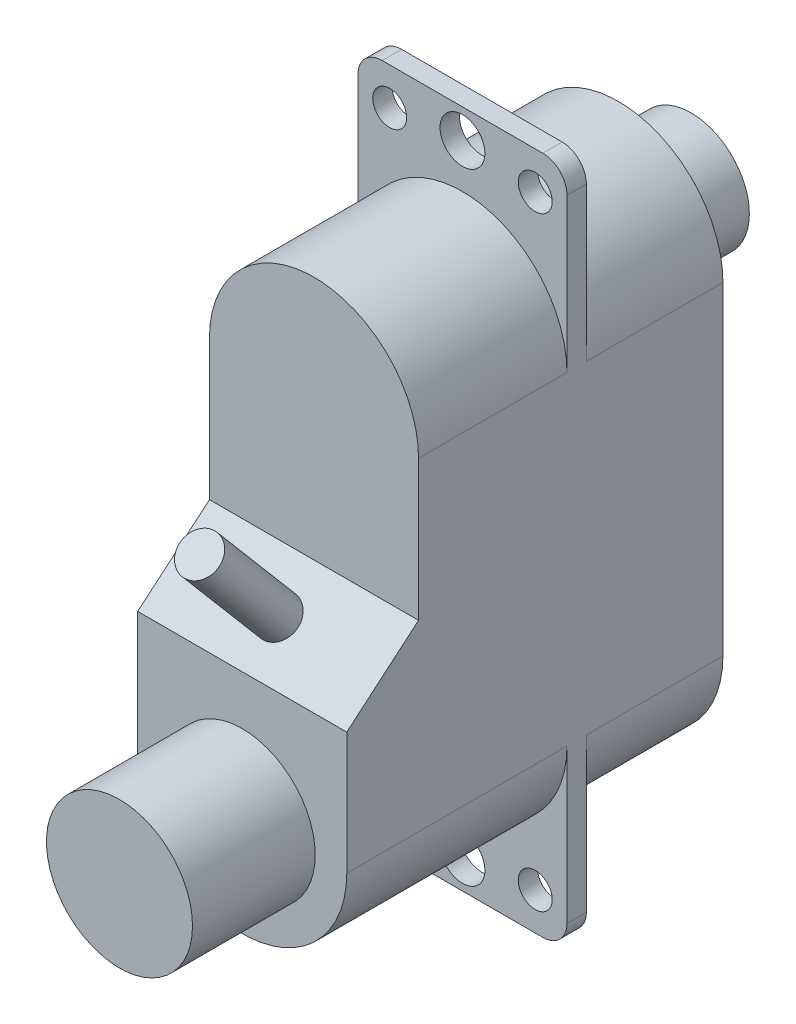
ISO-10303-21;
HEADER;
FILE_DESCRIPTION(('STEP AP214'),'2;1');
FILE_NAME('part.step','',(''),(''),'','','');
FILE_SCHEMA(('AUTOMOTIVE_DESIGN { 1 0 10303 214 1 1 1 1 }'));
ENDSEC;
DATA;
#1=APPLICATION_CONTEXT('core data for automotive mechanical design processes');
#2=APPLICATION_PROTOCOL_DEFINITION('international standard','automotive_design',2000,#1);
#3=PRODUCT_CONTEXT('',#1,'mechanical');
#4=PRODUCT('Part','Part','',(#3));
#5=PRODUCT_RELATED_PRODUCT_CATEGORY('part','',(#4));
#6=PRODUCT_DEFINITION_FORMATION('','',#4);
#7=PRODUCT_DEFINITION_CONTEXT('part definition',#1,'design');
#8=PRODUCT_DEFINITION('design','',#6,#7);
#9=PRODUCT_DEFINITION_SHAPE('','',#8);
#10=(LENGTH_UNIT() NAMED_UNIT(*) SI_UNIT(.MILLI.,.METRE.));
#11=(NAMED_UNIT(*) PLANE_ANGLE_UNIT() SI_UNIT($,.RADIAN.));
#12=(NAMED_UNIT(*) SI_UNIT($,.STERADIAN.) SOLID_ANGLE_UNIT());
#13=UNCERTAINTY_MEASURE_WITH_UNIT(LENGTH_MEASURE(1.E-05),#10,'distance_accuracy_value','');
#14=(GEOMETRIC_REPRESENTATION_CONTEXT(3) GLOBAL_UNCERTAINTY_ASSIGNED_CONTEXT((#13)) GLOBAL_UNIT_ASSIGNED_CONTEXT((#10,
#11,#12)) REPRESENTATION_CONTEXT('',''));
#15=CARTESIAN_POINT('',(0.,0.,0.));
#16=DIRECTION('',(0.,0.,1.));
#17=DIRECTION('',(1.,0.,0.));
#18=AXIS2_PLACEMENT_3D('',#15,#16,#17);
#19=CARTESIAN_POINT('',(0.,0.,18.51));
#20=DIRECTION('',(0.,0.,-1.));
#21=DIRECTION('',(-1.,0.,0.));
#22=AXIS2_PLACEMENT_3D('',#19,#20,#21);
#23=CYLINDRICAL_SURFACE('',#22,4.31);
#24=CARTESIAN_POINT('',(0.,0.,9.43));
#25=DIRECTION('',(0.,0.,-1.));
#26=DIRECTION('',(-1.,0.,0.));
#27=AXIS2_PLACEMENT_3D('',#24,#25,#26);
#28=CIRCLE('',#27,4.31);
#29=CARTESIAN_POINT('',(-4.31,0.,9.43));
#30=VERTEX_POINT('',#29);
#31=CARTESIAN_POINT('',(4.31,0.,9.43));
#32=VERTEX_POINT('',#31);
#33=EDGE_CURVE('E361',#30,#32,#28,.T.);
#34=ORIENTED_EDGE('',*,*,#33,.F.);
#35=DIRECTION('',(0.,0.,-1.));
#36=VECTOR('',#35,1.);
#37=CARTESIAN_POINT('',(-4.31,0.,18.51));
#38=LINE('',#37,#36);
#39=CARTESIAN_POINT('',(-4.31,0.,15.55));
#40=VERTEX_POINT('',#39);
#41=EDGE_CURVE('E439',#40,#30,#38,.T.);
#42=ORIENTED_EDGE('',*,*,#41,.F.);
#43=CARTESIAN_POINT('',(0.,0.,15.55));
#44=DIRECTION('',(0.,0.,-1.));
#45=DIRECTION('',(0.,1.,0.));
#46=AXIS2_PLACEMENT_3D('',#43,#44,#45);
#47=CIRCLE('',#46,4.31);
#48=CARTESIAN_POINT('',(4.31,0.,15.55));
#49=VERTEX_POINT('',#48);
#50=EDGE_CURVE('E392',#40,#49,#47,.T.);
#51=ORIENTED_EDGE('',*,*,#50,.T.);
#52=DIRECTION('',(0.,0.,-1.));
#53=VECTOR('',#52,1.);
#54=CARTESIAN_POINT('',(4.31,0.,18.51));
#55=LINE('',#54,#53);
#56=EDGE_CURVE('E424',#49,#32,#55,.T.);
#57=ORIENTED_EDGE('',*,*,#56,.T.);
#58=EDGE_LOOP('',(#34,#42,#51,#57));
#59=FACE_BOUND('',#58,.T.);
#60=ADVANCED_FACE('F49',(#59),#23,.T.);
#61=CARTESIAN_POINT('',(0.,-13.34,18.51));
#62=DIRECTION('',(0.,0.,-1.));
#63=DIRECTION('',(-1.,0.,0.));
#64=AXIS2_PLACEMENT_3D('',#61,#62,#63);
#65=CYLINDRICAL_SURFACE('',#64,4.31);
#66=CARTESIAN_POINT('',(0.,-13.34,9.43));
#67=DIRECTION('',(0.,0.,-1.));
#68=DIRECTION('',(-1.,0.,0.));
#69=AXIS2_PLACEMENT_3D('',#66,#67,#68);
#70=CIRCLE('',#69,4.31);
#71=CARTESIAN_POINT('',(4.31,-13.34,9.43));
#72=VERTEX_POINT('',#71);
#73=CARTESIAN_POINT('',(-4.31,-13.34,9.43));
#74=VERTEX_POINT('',#73);
#75=EDGE_CURVE('E357',#72,#74,#70,.T.);
#76=ORIENTED_EDGE('',*,*,#75,.F.);
#77=DIRECTION('',(0.,0.,-1.));
#78=VECTOR('',#77,1.);
#79=CARTESIAN_POINT('',(4.31,-13.34,18.51));
#80=LINE('',#79,#78);
#81=CARTESIAN_POINT('',(4.31,-13.34,18.51));
#82=VERTEX_POINT('',#81);
#83=EDGE_CURVE('E429',#82,#72,#80,.T.);
#84=ORIENTED_EDGE('',*,*,#83,.F.);
#85=CARTESIAN_POINT('',(0.,-13.34,18.51));
#86=DIRECTION('',(0.,0.,1.));
#87=DIRECTION('',(1.,0.,0.));
#88=AXIS2_PLACEMENT_3D('',#85,#86,#87);
#89=CIRCLE('',#88,4.31);
#90=CARTESIAN_POINT('',(-4.31,-13.34,18.51));
#91=VERTEX_POINT('',#90);
#92=EDGE_CURVE('E401',#91,#82,#89,.T.);
#93=ORIENTED_EDGE('',*,*,#92,.F.);
#94=DIRECTION('',(0.,0.,-1.));
#95=VECTOR('',#94,1.);
#96=CARTESIAN_POINT('',(-4.31,-13.34,18.51));
#97=LINE('',#96,#95);
#98=EDGE_CURVE('E434',#91,#74,#97,.T.);
#99=ORIENTED_EDGE('',*,*,#98,.T.);
#100=EDGE_LOOP('',(#76,#84,#93,#99));
#101=FACE_BOUND('',#100,.T.);
#102=ADVANCED_FACE('F491',(#101),#65,.T.);
#103=CARTESIAN_POINT('',(0.,0.,3.));
#104=DIRECTION('',(0.,0.,-1.));
#105=DIRECTION('',(-1.,0.,0.));
#106=AXIS2_PLACEMENT_3D('',#103,#104,#105);
#107=CYLINDRICAL_SURFACE('',#106,2.4);
#108=CARTESIAN_POINT('',(0.,0.,3.));
#109=DIRECTION('',(0.,0.,1.));
#110=DIRECTION('',(1.,0.,0.));
#111=AXIS2_PLACEMENT_3D('',#108,#109,#110);
#112=CIRCLE('',#111,2.4);
#113=CARTESIAN_POINT('',(2.4,0.,3.));
#114=VERTEX_POINT('',#113);
#115=EDGE_CURVE('E444',#114,#114,#112,.T.);
#116=ORIENTED_EDGE('',*,*,#115,.F.);
#117=EDGE_LOOP('',(#116));
#118=FACE_BOUND('',#117,.T.);
#119=CARTESIAN_POINT('',(0.,0.,0.));
#120=DIRECTION('',(0.,0.,1.));
#121=DIRECTION('',(1.,0.,0.));
#122=AXIS2_PLACEMENT_3D('',#119,#120,#121);
#123=CIRCLE('',#122,2.4);
#124=CARTESIAN_POINT('',(2.4,0.,0.));
#125=VERTEX_POINT('',#124);
#126=EDGE_CURVE('E443',#125,#125,#123,.T.);
#127=ORIENTED_EDGE('',*,*,#126,.T.);
#128=EDGE_LOOP('',(#127));
#129=FACE_BOUND('',#128,.T.);
#130=ADVANCED_FACE('F51',(#118,#129),#107,.T.);
#131=CARTESIAN_POINT('',(0.,0.,0.));
#132=DIRECTION('',(0.,0.,1.));
#133=DIRECTION('',(1.,0.,0.));
#134=AXIS2_PLACEMENT_3D('',#131,#132,#133);
#135=PLANE('',#134);
#136=ORIENTED_EDGE('',*,*,#126,.F.);
#137=EDGE_LOOP('',(#136));
#138=FACE_BOUND('',#137,.T.);
#139=ADVANCED_FACE('F521',(#138),#135,.F.);
#140=CARTESIAN_POINT('',(-4.31,0.,8.63));
#141=VERTEX_POINT('',#140);
#142=CARTESIAN_POINT('',(-4.31,0.,3.));
#143=VERTEX_POINT('',#142);
#144=EDGE_CURVE('E438',#141,#143,#38,.T.);
#145=ORIENTED_EDGE('',*,*,#144,.F.);
#146=CARTESIAN_POINT('',(0.,0.,8.63));
#147=DIRECTION('',(0.,0.,-1.));
#148=DIRECTION('',(-1.,0.,0.));
#149=AXIS2_PLACEMENT_3D('',#146,#147,#148);
#150=CIRCLE('',#149,4.31);
#151=CARTESIAN_POINT('',(4.31,0.,8.63));
#152=VERTEX_POINT('',#151);
#153=EDGE_CURVE('E353',#141,#152,#150,.T.);
#154=ORIENTED_EDGE('',*,*,#153,.T.);
#155=CARTESIAN_POINT('',(4.31,0.,3.));
#156=VERTEX_POINT('',#155);
#157=EDGE_CURVE('E409',#152,#156,#55,.T.);
#158=ORIENTED_EDGE('',*,*,#157,.T.);
#159=CARTESIAN_POINT('',(0.,0.,3.));
#160=DIRECTION('',(0.,0.,1.));
#161=DIRECTION('',(1.,0.,0.));
#162=AXIS2_PLACEMENT_3D('',#159,#160,#161);
#163=CIRCLE('',#162,4.31);
#164=EDGE_CURVE('E397',#156,#143,#163,.T.);
#165=ORIENTED_EDGE('',*,*,#164,.T.);
#166=EDGE_LOOP('',(#145,#154,#158,#165));
#167=FACE_BOUND('',#166,.T.);
#168=ADVANCED_FACE('F512',(#167),#23,.T.);
#169=CARTESIAN_POINT('',(-4.31,0.,18.51));
#170=DIRECTION('',(1.,0.,0.));
#171=DIRECTION('',(0.,1.,0.));
#172=AXIS2_PLACEMENT_3D('',#169,#170,#171);
#173=PLANE('',#172);
#174=DIRECTION('',(0.,1.,0.));
#175=VECTOR('',#174,1.);
#176=CARTESIAN_POINT('',(-4.31,6.33,8.63));
#177=LINE('',#176,#175);
#178=CARTESIAN_POINT('',(-4.31,-18.2307201466614,8.63));
#179=VERTEX_POINT('',#178);
#180=CARTESIAN_POINT('',(-4.31,-13.34,8.63));
#181=VERTEX_POINT('',#180);
#182=EDGE_CURVE('E312',#179,#181,#177,.T.);
#183=ORIENTED_EDGE('',*,*,#182,.F.);
#184=DIRECTION('',(0.,0.,1.));
#185=VECTOR('',#184,1.);
#186=CARTESIAN_POINT('',(-4.31,-18.2307201466614,18.51));
#187=LINE('',#186,#185);
#188=CARTESIAN_POINT('',(-4.31,-18.2307201466614,9.43));
#189=VERTEX_POINT('',#188);
#190=EDGE_CURVE('E221',#179,#189,#187,.T.);
#191=ORIENTED_EDGE('',*,*,#190,.T.);
#192=DIRECTION('',(0.,1.,0.));
#193=VECTOR('',#192,1.);
#194=CARTESIAN_POINT('',(-4.31,6.33,9.43));
#195=LINE('',#194,#193);
#196=EDGE_CURVE('E286',#189,#74,#195,.T.);
#197=ORIENTED_EDGE('',*,*,#196,.T.);
#198=ORIENTED_EDGE('',*,*,#98,.F.);
#199=DIRECTION('',(0.,-1.,0.));
#200=VECTOR('',#199,1.);
#201=CARTESIAN_POINT('',(-4.31,0.,18.51));
#202=LINE('',#201,#200);
#203=CARTESIAN_POINT('',(-4.31,-8.3,18.51));
#204=VERTEX_POINT('',#203);
#205=EDGE_CURVE('E398',#204,#91,#202,.T.);
#206=ORIENTED_EDGE('',*,*,#205,.F.);
#207=DIRECTION('',(0.,0.646750428249599,-0.762701700246538));
#208=VECTOR('',#207,1.);
#209=CARTESIAN_POINT('',(-4.31,-5.79,15.55));
#210=LINE('',#209,#208);
#211=CARTESIAN_POINT('',(-4.31,-5.79,15.55));
#212=VERTEX_POINT('',#211);
#213=EDGE_CURVE('E380',#204,#212,#210,.T.);
#214=ORIENTED_EDGE('',*,*,#213,.T.);
#215=DIRECTION('',(0.,1.,0.));
#216=VECTOR('',#215,1.);
#217=CARTESIAN_POINT('',(-4.31,4.31,15.55));
#218=LINE('',#217,#216);
#219=EDGE_CURVE('E384',#212,#40,#218,.T.);
#220=ORIENTED_EDGE('',*,*,#219,.T.);
#221=ORIENTED_EDGE('',*,*,#41,.T.);
#222=CARTESIAN_POINT('',(-4.31,6.33,9.43));
#223=VERTEX_POINT('',#222);
#224=EDGE_CURVE('E285',#30,#223,#195,.T.);
#225=ORIENTED_EDGE('',*,*,#224,.T.);
#226=DIRECTION('',(0.,0.,-1.));
#227=VECTOR('',#226,1.);
#228=CARTESIAN_POINT('',(-4.31,6.33,9.43));
#229=LINE('',#228,#227);
#230=CARTESIAN_POINT('',(-4.31,6.33,8.63));
#231=VERTEX_POINT('',#230);
#232=EDGE_CURVE('E344',#223,#231,#229,.T.);
#233=ORIENTED_EDGE('',*,*,#232,.T.);
#234=EDGE_CURVE('E311',#141,#231,#177,.T.);
#235=ORIENTED_EDGE('',*,*,#234,.F.);
#236=ORIENTED_EDGE('',*,*,#144,.T.);
#237=DIRECTION('',(0.,-1.,0.));
#238=VECTOR('',#237,1.);
#239=CARTESIAN_POINT('',(-4.31,0.,3.));
#240=LINE('',#239,#238);
#241=CARTESIAN_POINT('',(-4.31,-13.34,3.));
#242=VERTEX_POINT('',#241);
#243=EDGE_CURVE('E413',#143,#242,#240,.T.);
#244=ORIENTED_EDGE('',*,*,#243,.T.);
#245=EDGE_CURVE('E433',#181,#242,#97,.T.);
#246=ORIENTED_EDGE('',*,*,#245,.F.);
#247=EDGE_LOOP('',(#183,#191,#197,#198,#206,#214,#220,#221,#225,#233,#235,#236,#244,#246));
#248=FACE_BOUND('',#247,.T.);
#249=ADVANCED_FACE('F466',(#248),#173,.F.);
#250=CARTESIAN_POINT('',(4.31,-13.34,8.63));
#251=VERTEX_POINT('',#250);
#252=CARTESIAN_POINT('',(4.31,-13.34,3.));
#253=VERTEX_POINT('',#252);
#254=EDGE_CURVE('E428',#251,#253,#80,.T.);
#255=ORIENTED_EDGE('',*,*,#254,.F.);
#256=CARTESIAN_POINT('',(0.,-13.34,8.63));
#257=DIRECTION('',(0.,0.,-1.));
#258=DIRECTION('',(-1.,0.,0.));
#259=AXIS2_PLACEMENT_3D('',#256,#257,#258);
#260=CIRCLE('',#259,4.31);
#261=EDGE_CURVE('E334',#251,#181,#260,.T.);
#262=ORIENTED_EDGE('',*,*,#261,.T.);
#263=ORIENTED_EDGE('',*,*,#245,.T.);
#264=CARTESIAN_POINT('',(0.,-13.34,3.));
#265=DIRECTION('',(0.,0.,1.));
#266=DIRECTION('',(1.,0.,0.));
#267=AXIS2_PLACEMENT_3D('',#264,#265,#266);
#268=CIRCLE('',#267,4.31);
#269=EDGE_CURVE('E417',#242,#253,#268,.T.);
#270=ORIENTED_EDGE('',*,*,#269,.T.);
#271=EDGE_LOOP('',(#255,#262,#263,#270));
#272=FACE_BOUND('',#271,.T.);
#273=ADVANCED_FACE('F517',(#272),#65,.T.);
#274=CARTESIAN_POINT('',(4.31,0.,18.51));
#275=DIRECTION('',(-1.,0.,0.));
#276=DIRECTION('',(0.,-1.,0.));
#277=AXIS2_PLACEMENT_3D('',#274,#275,#276);
#278=PLANE('',#277);
#279=ORIENTED_EDGE('',*,*,#157,.F.);
#280=DIRECTION('',(0.,-1.,0.));
#281=VECTOR('',#280,1.);
#282=CARTESIAN_POINT('',(4.31,6.33,8.63));
#283=LINE('',#282,#281);
#284=CARTESIAN_POINT('',(4.31,6.33,8.63));
#285=VERTEX_POINT('',#284);
#286=EDGE_CURVE('E281',#285,#152,#283,.T.);
#287=ORIENTED_EDGE('',*,*,#286,.F.);
#288=DIRECTION('',(0.,0.,-1.));
#289=VECTOR('',#288,1.);
#290=CARTESIAN_POINT('',(4.31,6.33,9.43));
#291=LINE('',#290,#289);
#292=CARTESIAN_POINT('',(4.31,6.33,9.43));
#293=VERTEX_POINT('',#292);
#294=EDGE_CURVE('E335',#293,#285,#291,.T.);
#295=ORIENTED_EDGE('',*,*,#294,.F.);
#296=DIRECTION('',(0.,-1.,0.));
#297=VECTOR('',#296,1.);
#298=CARTESIAN_POINT('',(4.31,6.33,9.43));
#299=LINE('',#298,#297);
#300=EDGE_CURVE('E302',#293,#32,#299,.T.);
#301=ORIENTED_EDGE('',*,*,#300,.T.);
#302=ORIENTED_EDGE('',*,*,#56,.F.);
#303=DIRECTION('',(0.,1.,0.));
#304=VECTOR('',#303,1.);
#305=CARTESIAN_POINT('',(4.31,4.31,15.55));
#306=LINE('',#305,#304);
#307=CARTESIAN_POINT('',(4.31,-5.79,15.55));
#308=VERTEX_POINT('',#307);
#309=EDGE_CURVE('E376',#308,#49,#306,.T.);
#310=ORIENTED_EDGE('',*,*,#309,.F.);
#311=DIRECTION('',(0.,0.646750428249599,-0.762701700246538));
#312=VECTOR('',#311,1.);
#313=CARTESIAN_POINT('',(4.31,-5.79,15.55));
#314=LINE('',#313,#312);
#315=CARTESIAN_POINT('',(4.31,-8.3,18.51));
#316=VERTEX_POINT('',#315);
#317=EDGE_CURVE('E369',#316,#308,#314,.T.);
#318=ORIENTED_EDGE('',*,*,#317,.F.);
#319=DIRECTION('',(0.,1.,0.));
#320=VECTOR('',#319,1.);
#321=CARTESIAN_POINT('',(4.31,0.,18.51));
#322=LINE('',#321,#320);
#323=EDGE_CURVE('E405',#82,#316,#322,.T.);
#324=ORIENTED_EDGE('',*,*,#323,.F.);
#325=ORIENTED_EDGE('',*,*,#83,.T.);
#326=CARTESIAN_POINT('',(4.31,-19.67,9.43));
#327=VERTEX_POINT('',#326);
#328=EDGE_CURVE('E301',#72,#327,#299,.T.);
#329=ORIENTED_EDGE('',*,*,#328,.T.);
#330=DIRECTION('',(0.,0.,-1.));
#331=VECTOR('',#330,1.);
#332=CARTESIAN_POINT('',(4.31,-19.67,9.43));
#333=LINE('',#332,#331);
#334=CARTESIAN_POINT('',(4.31,-19.67,8.63));
#335=VERTEX_POINT('',#334);
#336=EDGE_CURVE('E330',#327,#335,#333,.T.);
#337=ORIENTED_EDGE('',*,*,#336,.T.);
#338=EDGE_CURVE('E327',#251,#335,#283,.T.);
#339=ORIENTED_EDGE('',*,*,#338,.F.);
#340=ORIENTED_EDGE('',*,*,#254,.T.);
#341=DIRECTION('',(0.,1.,0.));
#342=VECTOR('',#341,1.);
#343=CARTESIAN_POINT('',(4.31,0.,3.));
#344=LINE('',#343,#342);
#345=EDGE_CURVE('E402',#253,#156,#344,.T.);
#346=ORIENTED_EDGE('',*,*,#345,.T.);
#347=EDGE_LOOP('',(#279,#287,#295,#301,#302,#310,#318,#324,#325,#329,#337,#339,#340,#346));
#348=FACE_BOUND('',#347,.T.);
#349=ADVANCED_FACE('F481',(#348),#278,.F.);
#350=CARTESIAN_POINT('',(0.,0.,18.51));
#351=DIRECTION('',(0.,0.,1.));
#352=DIRECTION('',(1.,0.,0.));
#353=AXIS2_PLACEMENT_3D('',#350,#351,#352);
#354=PLANE('',#353);
#355=CARTESIAN_POINT('',(0.,-13.34,18.51));
#356=DIRECTION('',(0.,0.,1.));
#357=DIRECTION('',(1.,0.,0.));
#358=AXIS2_PLACEMENT_3D('',#355,#356,#357);
#359=CIRCLE('',#358,3.01);
#360=CARTESIAN_POINT('',(3.01,-13.34,18.51));
#361=VERTEX_POINT('',#360);
#362=EDGE_CURVE('E364',#361,#361,#359,.T.);
#363=ORIENTED_EDGE('',*,*,#362,.F.);
#364=EDGE_LOOP('',(#363));
#365=FACE_BOUND('',#364,.T.);
#366=DIRECTION('',(1.,0.,0.));
#367=VECTOR('',#366,1.);
#368=CARTESIAN_POINT('',(-4.31,-8.3,18.51));
#369=LINE('',#368,#367);
#370=EDGE_CURVE('E388',#204,#316,#369,.T.);
#371=ORIENTED_EDGE('',*,*,#370,.F.);
#372=ORIENTED_EDGE('',*,*,#205,.T.);
#373=ORIENTED_EDGE('',*,*,#92,.T.);
#374=ORIENTED_EDGE('',*,*,#323,.T.);
#375=EDGE_LOOP('',(#371,#372,#373,#374));
#376=FACE_BOUND('',#375,.T.);
#377=ADVANCED_FACE('F499',(#365,#376),#354,.T.);
#378=CARTESIAN_POINT('',(0.,0.,3.));
#379=DIRECTION('',(0.,0.,1.));
#380=DIRECTION('',(1.,0.,0.));
#381=AXIS2_PLACEMENT_3D('',#378,#379,#380);
#382=PLANE('',#381);
#383=ORIENTED_EDGE('',*,*,#115,.T.);
#384=EDGE_LOOP('',(#383));
#385=FACE_BOUND('',#384,.T.);
#386=ORIENTED_EDGE('',*,*,#164,.F.);
#387=ORIENTED_EDGE('',*,*,#345,.F.);
#388=ORIENTED_EDGE('',*,*,#269,.F.);
#389=ORIENTED_EDGE('',*,*,#243,.F.);
#390=EDGE_LOOP('',(#386,#387,#388,#389));
#391=FACE_BOUND('',#390,.T.);
#392=ADVANCED_FACE('F533',(#385,#391),#382,.F.);
#393=CARTESIAN_POINT('',(-4.31,4.31,15.55));
#394=DIRECTION('',(0.,0.,-1.));
#395=DIRECTION('',(0.,1.,0.));
#396=AXIS2_PLACEMENT_3D('',#393,#394,#395);
#397=PLANE('',#396);
#398=ORIENTED_EDGE('',*,*,#50,.F.);
#399=ORIENTED_EDGE('',*,*,#219,.F.);
#400=DIRECTION('',(1.,0.,0.));
#401=VECTOR('',#400,1.);
#402=CARTESIAN_POINT('',(-4.31,-5.79,15.55));
#403=LINE('',#402,#401);
#404=EDGE_CURVE('E389',#212,#308,#403,.T.);
#405=ORIENTED_EDGE('',*,*,#404,.T.);
#406=ORIENTED_EDGE('',*,*,#309,.T.);
#407=EDGE_LOOP('',(#398,#399,#405,#406));
#408=FACE_BOUND('',#407,.T.);
#409=ADVANCED_FACE('F559',(#408),#397,.F.);
#410=CARTESIAN_POINT('',(-4.31,-5.79,15.55));
#411=DIRECTION('',(0.,-0.762701700246538,-0.646750428249599));
#412=DIRECTION('',(0.,0.646750428249599,-0.762701700246538));
#413=AXIS2_PLACEMENT_3D('',#410,#411,#412);
#414=PLANE('',#413);
#415=CARTESIAN_POINT('',(0.,-7.04841118991035,17.0340227578226));
#416=DIRECTION('',(0.,-0.762701700246538,-0.646750428249599));
#417=DIRECTION('',(0.,0.646750428249599,-0.762701700246538));
#418=AXIS2_PLACEMENT_3D('',#415,#416,#417);
#419=CIRCLE('',#418,0.823117728845187);
#420=CARTESIAN_POINT('',(0.,-6.51605944627989,16.4062294665293));
#421=VERTEX_POINT('',#420);
#422=EDGE_CURVE('E448',#421,#421,#419,.F.);
#423=ORIENTED_EDGE('',*,*,#422,.F.);
#424=EDGE_LOOP('',(#423));
#425=FACE_BOUND('',#424,.T.);
#426=ORIENTED_EDGE('',*,*,#404,.F.);
#427=ORIENTED_EDGE('',*,*,#213,.F.);
#428=ORIENTED_EDGE('',*,*,#370,.T.);
#429=ORIENTED_EDGE('',*,*,#317,.T.);
#430=EDGE_LOOP('',(#426,#427,#428,#429));
#431=FACE_BOUND('',#430,.T.);
#432=ADVANCED_FACE('F562',(#425,#431),#414,.F.);
#433=CARTESIAN_POINT('',(0.,-13.34,23.57));
#434=DIRECTION('',(0.,0.,-1.));
#435=DIRECTION('',(-1.,0.,0.));
#436=AXIS2_PLACEMENT_3D('',#433,#434,#435);
#437=CYLINDRICAL_SURFACE('',#436,3.01);
#438=CARTESIAN_POINT('',(0.,-13.34,23.57));
#439=DIRECTION('',(0.,0.,1.));
#440=DIRECTION('',(1.,0.,0.));
#441=AXIS2_PLACEMENT_3D('',#438,#439,#440);
#442=CIRCLE('',#441,3.01);
#443=CARTESIAN_POINT('',(3.01,-13.34,23.57));
#444=VERTEX_POINT('',#443);
#445=EDGE_CURVE('E365',#444,#444,#442,.T.);
#446=ORIENTED_EDGE('',*,*,#445,.F.);
#447=EDGE_LOOP('',(#446));
#448=FACE_BOUND('',#447,.T.);
#449=ORIENTED_EDGE('',*,*,#362,.T.);
#450=EDGE_LOOP('',(#449));
#451=FACE_BOUND('',#450,.T.);
#452=ADVANCED_FACE('F564',(#448,#451),#437,.T.);
#453=CARTESIAN_POINT('',(0.,-13.34,23.57));
#454=DIRECTION('',(0.,0.,1.));
#455=DIRECTION('',(1.,0.,0.));
#456=AXIS2_PLACEMENT_3D('',#453,#454,#455);
#457=PLANE('',#456);
#458=ORIENTED_EDGE('',*,*,#445,.T.);
#459=EDGE_LOOP('',(#458));
#460=FACE_BOUND('',#459,.T.);
#461=ADVANCED_FACE('F571',(#460),#457,.T.);
#462=CARTESIAN_POINT('',(3.31,-20.67,9.43));
#463=DIRECTION('',(0.,-1.,0.));
#464=DIRECTION('',(1.,0.,0.));
#465=AXIS2_PLACEMENT_3D('',#462,#463,#464);
#466=PLANE('',#465);
#467=DIRECTION('',(0.,0.,1.));
#468=VECTOR('',#467,1.);
#469=CARTESIAN_POINT('',(-1.97662581496812,-20.67,9.43));
#470=LINE('',#469,#468);
#471=CARTESIAN_POINT('',(-1.97662581496812,-20.67,8.63));
#472=VERTEX_POINT('',#471);
#473=CARTESIAN_POINT('',(-1.97662581496812,-20.67,9.43));
#474=VERTEX_POINT('',#473);
#475=EDGE_CURVE('E64',#472,#474,#470,.T.);
#476=ORIENTED_EDGE('',*,*,#475,.F.);
#477=DIRECTION('',(-1.,0.,0.));
#478=VECTOR('',#477,1.);
#479=CARTESIAN_POINT('',(3.31,-20.67,8.63));
#480=LINE('',#479,#478);
#481=CARTESIAN_POINT('',(3.31,-20.67,8.63));
#482=VERTEX_POINT('',#481);
#483=EDGE_CURVE('E214',#482,#472,#480,.T.);
#484=ORIENTED_EDGE('',*,*,#483,.F.);
#485=DIRECTION('',(0.,0.,-1.));
#486=VECTOR('',#485,1.);
#487=CARTESIAN_POINT('',(3.31,-20.67,9.43));
#488=LINE('',#487,#486);
#489=CARTESIAN_POINT('',(3.31,-20.67,9.43));
#490=VERTEX_POINT('',#489);
#491=EDGE_CURVE('E306',#490,#482,#488,.T.);
#492=ORIENTED_EDGE('',*,*,#491,.F.);
#493=DIRECTION('',(-1.,0.,0.));
#494=VECTOR('',#493,1.);
#495=CARTESIAN_POINT('',(3.31,-20.67,9.43));
#496=LINE('',#495,#494);
#497=EDGE_CURVE('E280',#490,#474,#496,.T.);
#498=ORIENTED_EDGE('',*,*,#497,.T.);
#499=EDGE_LOOP('',(#476,#484,#492,#498));
#500=FACE_BOUND('',#499,.T.);
#501=ADVANCED_FACE('F486',(#500),#466,.T.);
#502=CARTESIAN_POINT('',(3.31,-19.67,9.43));
#503=DIRECTION('',(0.,0.,-1.));
#504=DIRECTION('',(-1.,0.,0.));
#505=AXIS2_PLACEMENT_3D('',#502,#503,#504);
#506=CYLINDRICAL_SURFACE('',#505,1.);
#507=CARTESIAN_POINT('',(3.31,-19.67,8.63));
#508=DIRECTION('',(0.,0.,-1.));
#509=DIRECTION('',(-1.,0.,0.));
#510=AXIS2_PLACEMENT_3D('',#507,#508,#509);
#511=CIRCLE('',#510,1.);
#512=EDGE_CURVE('E272',#335,#482,#511,.T.);
#513=ORIENTED_EDGE('',*,*,#512,.F.);
#514=ORIENTED_EDGE('',*,*,#336,.F.);
#515=CARTESIAN_POINT('',(3.31,-19.67,9.43));
#516=DIRECTION('',(0.,0.,-1.));
#517=DIRECTION('',(-1.,0.,0.));
#518=AXIS2_PLACEMENT_3D('',#515,#516,#517);
#519=CIRCLE('',#518,1.);
#520=EDGE_CURVE('E276',#327,#490,#519,.T.);
#521=ORIENTED_EDGE('',*,*,#520,.T.);
#522=ORIENTED_EDGE('',*,*,#491,.T.);
#523=EDGE_LOOP('',(#513,#514,#521,#522));
#524=FACE_BOUND('',#523,.T.);
#525=ADVANCED_FACE('F484',(#524),#506,.T.);
#526=CARTESIAN_POINT('',(3.,-19.1307638100292,9.43));
#527=DIRECTION('',(0.,0.,-1.));
#528=DIRECTION('',(-1.,0.,0.));
#529=AXIS2_PLACEMENT_3D('',#526,#527,#528);
#530=CYLINDRICAL_SURFACE('',#529,0.699999999999999);
#531=CARTESIAN_POINT('',(3.,-19.1307638100292,9.43));
#532=DIRECTION('',(0.,0.,-1.));
#533=DIRECTION('',(-1.,0.,0.));
#534=AXIS2_PLACEMENT_3D('',#531,#532,#533);
#535=CIRCLE('',#534,0.699999999999999);
#536=CARTESIAN_POINT('',(2.3,-19.1307638100292,9.43));
#537=VERTEX_POINT('',#536);
#538=EDGE_CURVE('E229',#537,#537,#535,.T.);
#539=ORIENTED_EDGE('',*,*,#538,.F.);
#540=EDGE_LOOP('',(#539));
#541=FACE_BOUND('',#540,.T.);
#542=CARTESIAN_POINT('',(3.,-19.1307638100292,8.63));
#543=DIRECTION('',(0.,0.,-1.));
#544=DIRECTION('',(-1.,0.,0.));
#545=AXIS2_PLACEMENT_3D('',#542,#543,#544);
#546=CIRCLE('',#545,0.699999999999999);
#547=CARTESIAN_POINT('',(2.3,-19.1307638100292,8.63));
#548=VERTEX_POINT('',#547);
#549=EDGE_CURVE('E228',#548,#548,#546,.T.);
#550=ORIENTED_EDGE('',*,*,#549,.T.);
#551=EDGE_LOOP('',(#550));
#552=FACE_BOUND('',#551,.T.);
#553=ADVANCED_FACE('F637',(#541,#552),#530,.F.);
#554=CARTESIAN_POINT('',(0.,-19.47,9.43));
#555=DIRECTION('',(0.,0.,-1.));
#556=DIRECTION('',(-1.,0.,0.));
#557=AXIS2_PLACEMENT_3D('',#554,#555,#556);
#558=CYLINDRICAL_SURFACE('',#557,0.924999999999999);
#559=CARTESIAN_POINT('',(0.,-19.47,9.43));
#560=DIRECTION('',(0.,0.,-1.));
#561=DIRECTION('',(1.,0.,0.));
#562=AXIS2_PLACEMENT_3D('',#559,#560,#561);
#563=CIRCLE('',#562,0.924999999999999);
#564=CARTESIAN_POINT('',(0.924999999999999,-19.47,9.43));
#565=VERTEX_POINT('',#564);
#566=EDGE_CURVE('E237',#565,#565,#563,.T.);
#567=ORIENTED_EDGE('',*,*,#566,.F.);
#568=EDGE_LOOP('',(#567));
#569=FACE_BOUND('',#568,.T.);
#570=CARTESIAN_POINT('',(0.,-19.47,8.63));
#571=DIRECTION('',(0.,0.,-1.));
#572=DIRECTION('',(1.,0.,0.));
#573=AXIS2_PLACEMENT_3D('',#570,#571,#572);
#574=CIRCLE('',#573,0.924999999999999);
#575=CARTESIAN_POINT('',(0.924999999999999,-19.47,8.63));
#576=VERTEX_POINT('',#575);
#577=EDGE_CURVE('E233',#576,#576,#574,.T.);
#578=ORIENTED_EDGE('',*,*,#577,.T.);
#579=EDGE_LOOP('',(#578));
#580=FACE_BOUND('',#579,.T.);
#581=ADVANCED_FACE('F644',(#569,#580),#558,.F.);
#582=CARTESIAN_POINT('',(-3.,-19.1307638100292,9.43));
#583=DIRECTION('',(0.,0.,-1.));
#584=DIRECTION('',(-1.,0.,0.));
#585=AXIS2_PLACEMENT_3D('',#582,#583,#584);
#586=CYLINDRICAL_SURFACE('',#585,0.699999999999999);
#587=CARTESIAN_POINT('',(-3.,-19.1307638100292,8.63));
#588=DIRECTION('',(0.,0.,-1.));
#589=DIRECTION('',(1.,0.,0.));
#590=AXIS2_PLACEMENT_3D('',#587,#588,#589);
#591=CIRCLE('',#590,0.699999999999999);
#592=CARTESIAN_POINT('',(-2.9425813665677,-18.433122712806,8.63));
#593=VERTEX_POINT('',#592);
#594=CARTESIAN_POINT('',(-2.8528575473326,-18.4464034527443,8.63));
#595=VERTEX_POINT('',#594);
#596=EDGE_CURVE('E241',#593,#595,#591,.T.);
#597=ORIENTED_EDGE('',*,*,#596,.T.);
#598=DIRECTION('',(0.,0.,-1.));
#599=VECTOR('',#598,1.);
#600=CARTESIAN_POINT('',(-2.8528575473326,-18.4464034527443,18.63));
#601=LINE('',#600,#599);
#602=CARTESIAN_POINT('',(-2.8528575473326,-18.4464034527443,9.43));
#603=VERTEX_POINT('',#602);
#604=EDGE_CURVE('E197',#603,#595,#601,.T.);
#605=ORIENTED_EDGE('',*,*,#604,.F.);
#606=CARTESIAN_POINT('',(-3.,-19.1307638100292,9.43));
#607=DIRECTION('',(0.,0.,-1.));
#608=DIRECTION('',(1.,0.,0.));
#609=AXIS2_PLACEMENT_3D('',#606,#607,#608);
#610=CIRCLE('',#609,0.699999999999999);
#611=CARTESIAN_POINT('',(-2.9425813665677,-18.433122712806,9.43));
#612=VERTEX_POINT('',#611);
#613=EDGE_CURVE('E245',#612,#603,#610,.T.);
#614=ORIENTED_EDGE('',*,*,#613,.F.);
#615=DIRECTION('',(0.,0.,-1.));
#616=VECTOR('',#615,1.);
#617=CARTESIAN_POINT('',(-2.9425813665677,-18.433122712806,9.43));
#618=LINE('',#617,#616);
#619=EDGE_CURVE('E72',#612,#593,#618,.T.);
#620=ORIENTED_EDGE('',*,*,#619,.T.);
#621=EDGE_LOOP('',(#597,#605,#614,#620));
#622=FACE_BOUND('',#621,.T.);
#623=ADVANCED_FACE('F462',(#622),#586,.F.);
#624=CARTESIAN_POINT('',(3.31,-19.67,8.63));
#625=DIRECTION('',(0.,0.,-1.));
#626=DIRECTION('',(-1.,0.,0.));
#627=AXIS2_PLACEMENT_3D('',#624,#625,#626);
#628=PLANE('',#627);
#629=DIRECTION('',(0.98922211863676,-0.146422675838816,0.));
#630=VECTOR('',#629,1.);
#631=CARTESIAN_POINT('',(-5.69597748645793,-18.0255705362795,8.63));
#632=LINE('',#631,#630);
#633=EDGE_CURVE('E198',#179,#593,#632,.T.);
#634=ORIENTED_EDGE('',*,*,#633,.F.);
#635=ORIENTED_EDGE('',*,*,#182,.T.);
#636=ORIENTED_EDGE('',*,*,#261,.F.);
#637=ORIENTED_EDGE('',*,*,#338,.T.);
#638=ORIENTED_EDGE('',*,*,#512,.T.);
#639=ORIENTED_EDGE('',*,*,#483,.T.);
#640=DIRECTION('',(0.197051631356477,-0.98039311226658,0.));
#641=VECTOR('',#640,1.);
#642=CARTESIAN_POINT('',(-2.31372482141339,-18.9928276680796,8.63));
#643=LINE('',#642,#641);
#644=CARTESIAN_POINT('',(-2.31372482141339,-18.9928276680796,8.63));
#645=VERTEX_POINT('',#644);
#646=EDGE_CURVE('E193',#645,#472,#643,.T.);
#647=ORIENTED_EDGE('',*,*,#646,.F.);
#648=CARTESIAN_POINT('',(-2.94631486663026,-19.0777950515396,8.63));
#649=DIRECTION('',(0.,0.,-1.));
#650=DIRECTION('',(-1.,0.,0.));
#651=AXIS2_PLACEMENT_3D('',#648,#649,#650);
#652=CIRCLE('',#651,0.638270805817955);
#653=EDGE_CURVE('E201',#595,#645,#652,.T.);
#654=ORIENTED_EDGE('',*,*,#653,.F.);
#655=ORIENTED_EDGE('',*,*,#596,.F.);
#656=EDGE_LOOP('',(#634,#635,#636,#637,#638,#639,#647,#654,#655));
#657=FACE_BOUND('',#656,.T.);
#658=ORIENTED_EDGE('',*,*,#577,.F.);
#659=EDGE_LOOP('',(#658));
#660=FACE_BOUND('',#659,.T.);
#661=ORIENTED_EDGE('',*,*,#549,.F.);
#662=EDGE_LOOP('',(#661));
#663=FACE_BOUND('',#662,.T.);
#664=ADVANCED_FACE('F210',(#657,#660,#663),#628,.T.);
#665=CARTESIAN_POINT('',(3.31,-19.67,9.43));
#666=DIRECTION('',(0.,0.,-1.));
#667=DIRECTION('',(-1.,0.,0.));
#668=AXIS2_PLACEMENT_3D('',#665,#666,#667);
#669=PLANE('',#668);
#670=ORIENTED_EDGE('',*,*,#196,.F.);
#671=DIRECTION('',(0.98922211863676,-0.146422675838816,0.));
#672=VECTOR('',#671,1.);
#673=CARTESIAN_POINT('',(3.35510209012072,-19.365293199031,9.43));
#674=LINE('',#673,#672);
#675=EDGE_CURVE('E13',#189,#612,#674,.T.);
#676=ORIENTED_EDGE('',*,*,#675,.T.);
#677=ORIENTED_EDGE('',*,*,#613,.T.);
#678=CARTESIAN_POINT('',(-2.94631486663026,-19.0777950515396,9.43));
#679=DIRECTION('',(0.,0.,-1.));
#680=DIRECTION('',(-1.,0.,0.));
#681=AXIS2_PLACEMENT_3D('',#678,#679,#680);
#682=CIRCLE('',#681,0.638270805817955);
#683=CARTESIAN_POINT('',(-2.31372482141339,-18.9928276680796,9.43));
#684=VERTEX_POINT('',#683);
#685=EDGE_CURVE('E57',#603,#684,#682,.T.);
#686=ORIENTED_EDGE('',*,*,#685,.T.);
#687=DIRECTION('',(0.197051631356477,-0.98039311226658,0.));
#688=VECTOR('',#687,1.);
#689=CARTESIAN_POINT('',(-1.9645376572339,-20.7301423418879,9.43));
#690=LINE('',#689,#688);
#691=EDGE_CURVE('E194',#684,#474,#690,.T.);
#692=ORIENTED_EDGE('',*,*,#691,.T.);
#693=ORIENTED_EDGE('',*,*,#497,.F.);
#694=ORIENTED_EDGE('',*,*,#520,.F.);
#695=ORIENTED_EDGE('',*,*,#328,.F.);
#696=ORIENTED_EDGE('',*,*,#75,.T.);
#697=EDGE_LOOP('',(#670,#676,#677,#686,#692,#693,#694,#695,#696));
#698=FACE_BOUND('',#697,.T.);
#699=ORIENTED_EDGE('',*,*,#566,.T.);
#700=EDGE_LOOP('',(#699));
#701=FACE_BOUND('',#700,.T.);
#702=ORIENTED_EDGE('',*,*,#538,.T.);
#703=EDGE_LOOP('',(#702));
#704=FACE_BOUND('',#703,.T.);
#705=ADVANCED_FACE('F457',(#698,#701,#704),#669,.F.);
#706=CARTESIAN_POINT('',(3.,5.79076381002915,9.43));
#707=DIRECTION('',(0.,0.,-1.));
#708=DIRECTION('',(1.,0.,0.));
#709=AXIS2_PLACEMENT_3D('',#706,#707,#708);
#710=CIRCLE('',#709,0.7);
#711=CARTESIAN_POINT('',(3.7,5.79076381002915,9.43));
#712=VERTEX_POINT('',#711);
#713=EDGE_CURVE('E252',#712,#712,#710,.T.);
#714=ORIENTED_EDGE('',*,*,#713,.T.);
#715=EDGE_LOOP('',(#714));
#716=FACE_BOUND('',#715,.T.);
#717=CARTESIAN_POINT('',(-3.,5.79076381002915,9.43));
#718=DIRECTION('',(0.,0.,-1.));
#719=DIRECTION('',(-1.,0.,0.));
#720=AXIS2_PLACEMENT_3D('',#717,#718,#719);
#721=CIRCLE('',#720,0.7);
#722=CARTESIAN_POINT('',(-3.7,5.79076381002915,9.43));
#723=VERTEX_POINT('',#722);
#724=EDGE_CURVE('E260',#723,#723,#721,.T.);
#725=ORIENTED_EDGE('',*,*,#724,.T.);
#726=EDGE_LOOP('',(#725));
#727=FACE_BOUND('',#726,.T.);
#728=CARTESIAN_POINT('',(0.,6.13,9.43));
#729=DIRECTION('',(0.,0.,-1.));
#730=DIRECTION('',(-1.,0.,0.));
#731=AXIS2_PLACEMENT_3D('',#728,#729,#730);
#732=CIRCLE('',#731,0.925);
#733=CARTESIAN_POINT('',(-0.925,6.13,9.43));
#734=VERTEX_POINT('',#733);
#735=EDGE_CURVE('E268',#734,#734,#732,.T.);
#736=ORIENTED_EDGE('',*,*,#735,.T.);
#737=EDGE_LOOP('',(#736));
#738=FACE_BOUND('',#737,.T.);
#739=ORIENTED_EDGE('',*,*,#224,.F.);
#740=ORIENTED_EDGE('',*,*,#33,.T.);
#741=ORIENTED_EDGE('',*,*,#300,.F.);
#742=CARTESIAN_POINT('',(3.31,6.33,9.43));
#743=DIRECTION('',(0.,0.,-1.));
#744=DIRECTION('',(-1.,0.,0.));
#745=AXIS2_PLACEMENT_3D('',#742,#743,#744);
#746=CIRCLE('',#745,1.);
#747=CARTESIAN_POINT('',(3.31,7.33,9.43));
#748=VERTEX_POINT('',#747);
#749=EDGE_CURVE('E297',#748,#293,#746,.T.);
#750=ORIENTED_EDGE('',*,*,#749,.F.);
#751=DIRECTION('',(1.,0.,0.));
#752=VECTOR('',#751,1.);
#753=CARTESIAN_POINT('',(3.31,7.33,9.43));
#754=LINE('',#753,#752);
#755=CARTESIAN_POINT('',(-3.31,7.33,9.43));
#756=VERTEX_POINT('',#755);
#757=EDGE_CURVE('E293',#756,#748,#754,.T.);
#758=ORIENTED_EDGE('',*,*,#757,.F.);
#759=CARTESIAN_POINT('',(-3.31,6.33,9.43));
#760=DIRECTION('',(0.,0.,-1.));
#761=DIRECTION('',(1.,0.,0.));
#762=AXIS2_PLACEMENT_3D('',#759,#760,#761);
#763=CIRCLE('',#762,1.);
#764=EDGE_CURVE('E289',#223,#756,#763,.T.);
#765=ORIENTED_EDGE('',*,*,#764,.F.);
#766=EDGE_LOOP('',(#739,#740,#741,#750,#758,#765));
#767=FACE_BOUND('',#766,.T.);
#768=ADVANCED_FACE('F545',(#716,#727,#738,#767),#669,.F.);
#769=CARTESIAN_POINT('',(0.,6.13,8.63));
#770=DIRECTION('',(0.,0.,-1.));
#771=DIRECTION('',(-1.,0.,0.));
#772=AXIS2_PLACEMENT_3D('',#769,#770,#771);
#773=CIRCLE('',#772,0.925);
#774=CARTESIAN_POINT('',(-0.925,6.13,8.63));
#775=VERTEX_POINT('',#774);
#776=EDGE_CURVE('E264',#775,#775,#773,.T.);
#777=ORIENTED_EDGE('',*,*,#776,.F.);
#778=EDGE_LOOP('',(#777));
#779=FACE_BOUND('',#778,.T.);
#780=CARTESIAN_POINT('',(-3.,5.79076381002915,8.63));
#781=DIRECTION('',(0.,0.,-1.));
#782=DIRECTION('',(-1.,0.,0.));
#783=AXIS2_PLACEMENT_3D('',#780,#781,#782);
#784=CIRCLE('',#783,0.7);
#785=CARTESIAN_POINT('',(-3.7,5.79076381002915,8.63));
#786=VERTEX_POINT('',#785);
#787=EDGE_CURVE('E256',#786,#786,#784,.T.);
#788=ORIENTED_EDGE('',*,*,#787,.F.);
#789=EDGE_LOOP('',(#788));
#790=FACE_BOUND('',#789,.T.);
#791=CARTESIAN_POINT('',(3.,5.79076381002915,8.63));
#792=DIRECTION('',(0.,0.,-1.));
#793=DIRECTION('',(1.,0.,0.));
#794=AXIS2_PLACEMENT_3D('',#791,#792,#793);
#795=CIRCLE('',#794,0.7);
#796=CARTESIAN_POINT('',(3.7,5.79076381002915,8.63));
#797=VERTEX_POINT('',#796);
#798=EDGE_CURVE('E249',#797,#797,#795,.T.);
#799=ORIENTED_EDGE('',*,*,#798,.F.);
#800=EDGE_LOOP('',(#799));
#801=FACE_BOUND('',#800,.T.);
#802=ORIENTED_EDGE('',*,*,#153,.F.);
#803=ORIENTED_EDGE('',*,*,#234,.T.);
#804=CARTESIAN_POINT('',(-3.31,6.33,8.63));
#805=DIRECTION('',(0.,0.,-1.));
#806=DIRECTION('',(1.,0.,0.));
#807=AXIS2_PLACEMENT_3D('',#804,#805,#806);
#808=CIRCLE('',#807,1.);
#809=CARTESIAN_POINT('',(-3.31,7.33,8.63));
#810=VERTEX_POINT('',#809);
#811=EDGE_CURVE('E315',#231,#810,#808,.T.);
#812=ORIENTED_EDGE('',*,*,#811,.T.);
#813=DIRECTION('',(1.,0.,0.));
#814=VECTOR('',#813,1.);
#815=CARTESIAN_POINT('',(3.31,7.33,8.63));
#816=LINE('',#815,#814);
#817=CARTESIAN_POINT('',(3.31,7.33,8.63));
#818=VERTEX_POINT('',#817);
#819=EDGE_CURVE('E319',#810,#818,#816,.T.);
#820=ORIENTED_EDGE('',*,*,#819,.T.);
#821=CARTESIAN_POINT('',(3.31,6.33,8.63));
#822=DIRECTION('',(0.,0.,-1.));
#823=DIRECTION('',(-1.,0.,0.));
#824=AXIS2_PLACEMENT_3D('',#821,#822,#823);
#825=CIRCLE('',#824,1.);
#826=EDGE_CURVE('E323',#818,#285,#825,.T.);
#827=ORIENTED_EDGE('',*,*,#826,.T.);
#828=ORIENTED_EDGE('',*,*,#286,.T.);
#829=EDGE_LOOP('',(#802,#803,#812,#820,#827,#828));
#830=FACE_BOUND('',#829,.T.);
#831=ADVANCED_FACE('F553',(#779,#790,#801,#830),#628,.T.);
#832=CARTESIAN_POINT('',(3.31,6.33,9.43));
#833=DIRECTION('',(0.,0.,-1.));
#834=DIRECTION('',(-1.,0.,0.));
#835=AXIS2_PLACEMENT_3D('',#832,#833,#834);
#836=CYLINDRICAL_SURFACE('',#835,1.);
#837=ORIENTED_EDGE('',*,*,#826,.F.);
#838=DIRECTION('',(0.,0.,-1.));
#839=VECTOR('',#838,1.);
#840=CARTESIAN_POINT('',(3.31,7.33,9.43));
#841=LINE('',#840,#839);
#842=EDGE_CURVE('E338',#748,#818,#841,.T.);
#843=ORIENTED_EDGE('',*,*,#842,.F.);
#844=ORIENTED_EDGE('',*,*,#749,.T.);
#845=ORIENTED_EDGE('',*,*,#294,.T.);
#846=EDGE_LOOP('',(#837,#843,#844,#845));
#847=FACE_BOUND('',#846,.T.);
#848=ADVANCED_FACE('F557',(#847),#836,.T.);
#849=CARTESIAN_POINT('',(3.31,7.33,9.43));
#850=DIRECTION('',(0.,1.,0.));
#851=DIRECTION('',(0.,0.,1.));
#852=AXIS2_PLACEMENT_3D('',#849,#850,#851);
#853=PLANE('',#852);
#854=ORIENTED_EDGE('',*,*,#819,.F.);
#855=DIRECTION('',(0.,0.,-1.));
#856=VECTOR('',#855,1.);
#857=CARTESIAN_POINT('',(-3.31,7.33,9.43));
#858=LINE('',#857,#856);
#859=EDGE_CURVE('E341',#756,#810,#858,.T.);
#860=ORIENTED_EDGE('',*,*,#859,.F.);
#861=ORIENTED_EDGE('',*,*,#757,.T.);
#862=ORIENTED_EDGE('',*,*,#842,.T.);
#863=EDGE_LOOP('',(#854,#860,#861,#862));
#864=FACE_BOUND('',#863,.T.);
#865=ADVANCED_FACE('F550',(#864),#853,.T.);
#866=CARTESIAN_POINT('',(-3.31,6.33,9.43));
#867=DIRECTION('',(0.,0.,-1.));
#868=DIRECTION('',(-1.,0.,0.));
#869=AXIS2_PLACEMENT_3D('',#866,#867,#868);
#870=CYLINDRICAL_SURFACE('',#869,1.);
#871=ORIENTED_EDGE('',*,*,#811,.F.);
#872=ORIENTED_EDGE('',*,*,#232,.F.);
#873=ORIENTED_EDGE('',*,*,#764,.T.);
#874=ORIENTED_EDGE('',*,*,#859,.T.);
#875=EDGE_LOOP('',(#871,#872,#873,#874));
#876=FACE_BOUND('',#875,.T.);
#877=ADVANCED_FACE('F543',(#876),#870,.T.);
#878=CARTESIAN_POINT('',(0.,6.13,9.43));
#879=DIRECTION('',(0.,0.,-1.));
#880=DIRECTION('',(-1.,0.,0.));
#881=AXIS2_PLACEMENT_3D('',#878,#879,#880);
#882=CYLINDRICAL_SURFACE('',#881,0.925);
#883=ORIENTED_EDGE('',*,*,#735,.F.);
#884=EDGE_LOOP('',(#883));
#885=FACE_BOUND('',#884,.T.);
#886=ORIENTED_EDGE('',*,*,#776,.T.);
#887=EDGE_LOOP('',(#886));
#888=FACE_BOUND('',#887,.T.);
#889=ADVANCED_FACE('F713',(#885,#888),#882,.F.);
#890=CARTESIAN_POINT('',(-3.,5.79076381002915,9.43));
#891=DIRECTION('',(0.,0.,-1.));
#892=DIRECTION('',(-1.,0.,0.));
#893=AXIS2_PLACEMENT_3D('',#890,#891,#892);
#894=CYLINDRICAL_SURFACE('',#893,0.7);
#895=ORIENTED_EDGE('',*,*,#724,.F.);
#896=EDGE_LOOP('',(#895));
#897=FACE_BOUND('',#896,.T.);
#898=ORIENTED_EDGE('',*,*,#787,.T.);
#899=EDGE_LOOP('',(#898));
#900=FACE_BOUND('',#899,.T.);
#901=ADVANCED_FACE('F721',(#897,#900),#894,.F.);
#902=CARTESIAN_POINT('',(3.,5.79076381002915,9.43));
#903=DIRECTION('',(0.,0.,-1.));
#904=DIRECTION('',(-1.,0.,0.));
#905=AXIS2_PLACEMENT_3D('',#902,#903,#904);
#906=CYLINDRICAL_SURFACE('',#905,0.7);
#907=ORIENTED_EDGE('',*,*,#713,.F.);
#908=EDGE_LOOP('',(#907));
#909=FACE_BOUND('',#908,.T.);
#910=ORIENTED_EDGE('',*,*,#798,.T.);
#911=EDGE_LOOP('',(#910));
#912=FACE_BOUND('',#911,.T.);
#913=ADVANCED_FACE('F730',(#909,#912),#906,.F.);
#914=CARTESIAN_POINT('',(0.,-3.23490268867766,20.2677748990706));
#915=DIRECTION('',(0.,-0.762701700246538,-0.646750428249599));
#916=DIRECTION('',(0.,0.646750428249599,-0.762701700246538));
#917=AXIS2_PLACEMENT_3D('',#914,#915,#916);
#918=CYLINDRICAL_SURFACE('',#917,0.823117728845187);
#919=CARTESIAN_POINT('',(0.,-3.23490268867766,20.2677748990706));
#920=DIRECTION('',(0.,0.762701700246539,0.646750428249599));
#921=DIRECTION('',(0.,-0.646750428249599,0.762701700246539));
#922=AXIS2_PLACEMENT_3D('',#919,#920,#921);
#923=CIRCLE('',#922,0.823117728845187);
#924=CARTESIAN_POINT('',(0.,-3.76725443230812,20.8955681903639));
#925=VERTEX_POINT('',#924);
#926=EDGE_CURVE('E224',#925,#925,#923,.T.);
#927=ORIENTED_EDGE('',*,*,#926,.F.);
#928=EDGE_LOOP('',(#927));
#929=FACE_BOUND('',#928,.T.);
#930=ORIENTED_EDGE('',*,*,#422,.T.);
#931=EDGE_LOOP('',(#930));
#932=FACE_BOUND('',#931,.T.);
#933=ADVANCED_FACE('F738',(#929,#932),#918,.T.);
#934=CARTESIAN_POINT('',(0.,-3.23490268867766,20.2677748990706));
#935=DIRECTION('',(0.,0.762701700246539,0.646750428249599));
#936=DIRECTION('',(0.,-0.646750428249599,0.762701700246539));
#937=AXIS2_PLACEMENT_3D('',#934,#935,#936);
#938=PLANE('',#937);
#939=ORIENTED_EDGE('',*,*,#926,.T.);
#940=EDGE_LOOP('',(#939));
#941=FACE_BOUND('',#940,.T.);
#942=ADVANCED_FACE('F746',(#941),#938,.T.);
#943=CARTESIAN_POINT('',(-2.31372482141339,-18.9928276680796,18.63));
#944=DIRECTION('',(0.98039311226658,0.197051631356477,0.));
#945=DIRECTION('',(-0.197051631356477,0.98039311226658,0.));
#946=AXIS2_PLACEMENT_3D('',#943,#944,#945);
#947=PLANE('',#946);
#948=ORIENTED_EDGE('',*,*,#475,.T.);
#949=ORIENTED_EDGE('',*,*,#691,.F.);
#950=DIRECTION('',(0.,0.,-1.));
#951=VECTOR('',#950,1.);
#952=CARTESIAN_POINT('',(-2.31372482141339,-18.9928276680796,18.63));
#953=LINE('',#952,#951);
#954=EDGE_CURVE('E189',#684,#645,#953,.T.);
#955=ORIENTED_EDGE('',*,*,#954,.T.);
#956=ORIENTED_EDGE('',*,*,#646,.T.);
#957=EDGE_LOOP('',(#948,#949,#955,#956));
#958=FACE_BOUND('',#957,.T.);
#959=ADVANCED_FACE('F191',(#958),#947,.F.);
#960=CARTESIAN_POINT('',(-2.94631486663026,-19.0777950515396,18.63));
#961=DIRECTION('',(0.,0.,-1.));
#962=DIRECTION('',(-1.,0.,0.));
#963=AXIS2_PLACEMENT_3D('',#960,#961,#962);
#964=CYLINDRICAL_SURFACE('',#963,0.638270805817955);
#965=ORIENTED_EDGE('',*,*,#604,.T.);
#966=ORIENTED_EDGE('',*,*,#653,.T.);
#967=ORIENTED_EDGE('',*,*,#954,.F.);
#968=ORIENTED_EDGE('',*,*,#685,.F.);
#969=EDGE_LOOP('',(#965,#966,#967,#968));
#970=FACE_BOUND('',#969,.T.);
#971=ADVANCED_FACE('F202',(#970),#964,.F.);
#972=CARTESIAN_POINT('',(-5.69597748645793,-18.0255705362795,18.63));
#973=DIRECTION('',(0.146422675838816,0.98922211863676,0.));
#974=DIRECTION('',(-0.98922211863676,0.146422675838816,0.));
#975=AXIS2_PLACEMENT_3D('',#972,#973,#974);
#976=PLANE('',#975);
#977=ORIENTED_EDGE('',*,*,#633,.T.);
#978=ORIENTED_EDGE('',*,*,#619,.F.);
#979=ORIENTED_EDGE('',*,*,#675,.F.);
#980=ORIENTED_EDGE('',*,*,#190,.F.);
#981=EDGE_LOOP('',(#977,#978,#979,#980));
#982=FACE_BOUND('',#981,.T.);
#983=ADVANCED_FACE('F501',(#982),#976,.F.);
#984=CLOSED_SHELL('',(#60,#102,#130,#139,#168,#249,#273,#349,#377,#392,#409,#432,#452,#461,#501,
#525,#553,#581,#623,#664,#705,#768,#831,#848,#865,#877,#889,#901,#913,#933,#942,#959,#971,#983));
#985=MANIFOLD_SOLID_BREP('B2',#984);
#986=ADVANCED_BREP_SHAPE_REPRESENTATION('',(#18,#985),#14);
#987=SHAPE_DEFINITION_REPRESENTATION(#9,#986);
ENDSEC;
END-ISO-10303-21;
